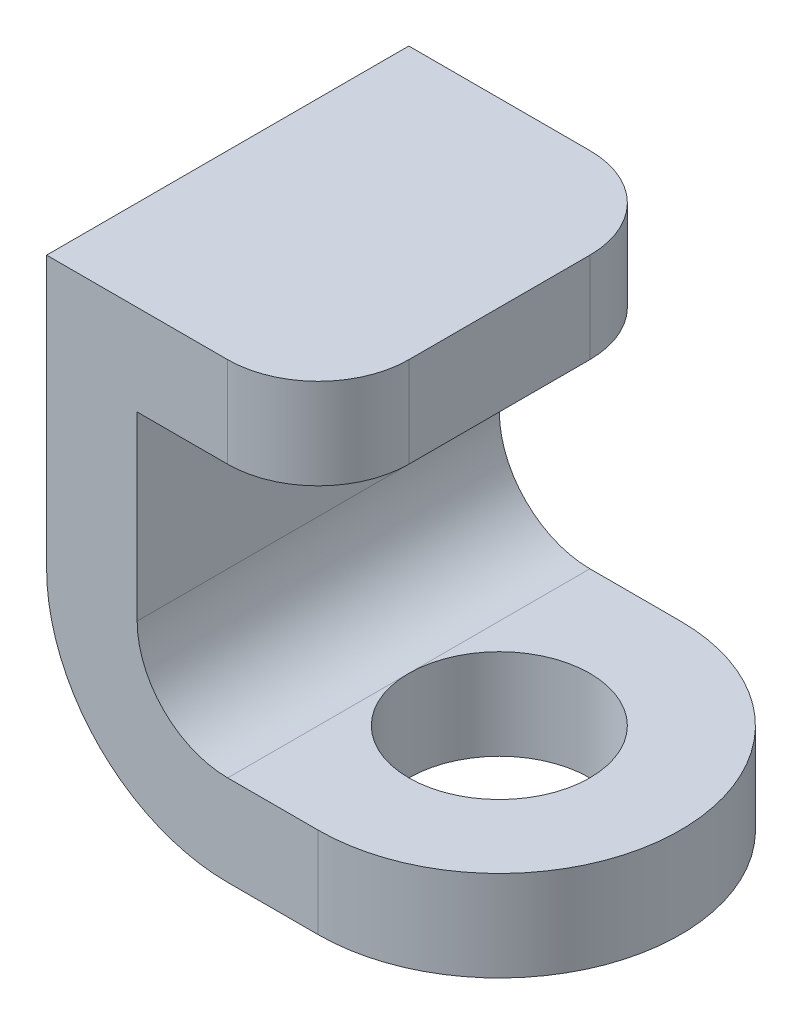
ISO-10303-21;
HEADER;
FILE_DESCRIPTION(('STEP AP214'),'2;1');
FILE_NAME('part.step','',(''),(''),'','','');
FILE_SCHEMA(('AUTOMOTIVE_DESIGN { 1 0 10303 214 1 1 1 1 }'));
ENDSEC;
DATA;
#1=APPLICATION_CONTEXT('core data for automotive mechanical design processes');
#2=APPLICATION_PROTOCOL_DEFINITION('international standard','automotive_design',2000,#1);
#3=PRODUCT_CONTEXT('',#1,'mechanical');
#4=PRODUCT('Part','Part','',(#3));
#5=PRODUCT_RELATED_PRODUCT_CATEGORY('part','',(#4));
#6=PRODUCT_DEFINITION_FORMATION('','',#4);
#7=PRODUCT_DEFINITION_CONTEXT('part definition',#1,'design');
#8=PRODUCT_DEFINITION('design','',#6,#7);
#9=PRODUCT_DEFINITION_SHAPE('','',#8);
#10=(LENGTH_UNIT() NAMED_UNIT(*) SI_UNIT(.MILLI.,.METRE.));
#11=(NAMED_UNIT(*) PLANE_ANGLE_UNIT() SI_UNIT($,.RADIAN.));
#12=(NAMED_UNIT(*) SI_UNIT($,.STERADIAN.) SOLID_ANGLE_UNIT());
#13=UNCERTAINTY_MEASURE_WITH_UNIT(LENGTH_MEASURE(1.E-05),#10,'distance_accuracy_value','');
#14=(GEOMETRIC_REPRESENTATION_CONTEXT(3) GLOBAL_UNCERTAINTY_ASSIGNED_CONTEXT((#13)) GLOBAL_UNIT_ASSIGNED_CONTEXT((#10,
#11,#12)) REPRESENTATION_CONTEXT('',''));
#15=CARTESIAN_POINT('',(0.,0.,0.));
#16=DIRECTION('',(0.,0.,1.));
#17=DIRECTION('',(1.,0.,0.));
#18=AXIS2_PLACEMENT_3D('',#15,#16,#17);
#19=CARTESIAN_POINT('',(-10.,25.,0.));
#20=DIRECTION('',(-1.,0.,0.));
#21=DIRECTION('',(0.,0.,1.));
#22=AXIS2_PLACEMENT_3D('',#19,#20,#21);
#23=PLANE('',#22);
#24=DIRECTION('',(0.,-1.,0.));
#25=VECTOR('',#24,1.);
#26=CARTESIAN_POINT('',(-10.,25.,10.));
#27=LINE('',#26,#25);
#28=CARTESIAN_POINT('',(-10.,20.,10.));
#29=VERTEX_POINT('',#28);
#30=CARTESIAN_POINT('',(-10.,10.,10.));
#31=VERTEX_POINT('',#30);
#32=EDGE_CURVE('E147',#29,#31,#27,.T.);
#33=ORIENTED_EDGE('',*,*,#32,.T.);
#34=DIRECTION('',(0.,0.,-1.));
#35=VECTOR('',#34,1.);
#36=CARTESIAN_POINT('',(-10.,10.,0.));
#37=LINE('',#36,#35);
#38=CARTESIAN_POINT('',(-10.,10.,-10.));
#39=VERTEX_POINT('',#38);
#40=EDGE_CURVE('E213',#31,#39,#37,.T.);
#41=ORIENTED_EDGE('',*,*,#40,.T.);
#42=DIRECTION('',(0.,-1.,0.));
#43=VECTOR('',#42,1.);
#44=CARTESIAN_POINT('',(-10.,25.,-10.));
#45=LINE('',#44,#43);
#46=CARTESIAN_POINT('',(-10.,20.,-10.));
#47=VERTEX_POINT('',#46);
#48=EDGE_CURVE('E149',#47,#39,#45,.T.);
#49=ORIENTED_EDGE('',*,*,#48,.F.);
#50=DIRECTION('',(0.,0.,-1.));
#51=VECTOR('',#50,1.);
#52=CARTESIAN_POINT('',(-10.,20.,10.));
#53=LINE('',#52,#51);
#54=EDGE_CURVE('E134',#29,#47,#53,.T.);
#55=ORIENTED_EDGE('',*,*,#54,.F.);
#56=EDGE_LOOP('',(#33,#41,#49,#55));
#57=FACE_BOUND('',#56,.T.);
#58=ADVANCED_FACE('F35',(#57),#23,.F.);
#59=CARTESIAN_POINT('',(0.,5.,10.));
#60=DIRECTION('',(0.,0.,-1.));
#61=DIRECTION('',(-1.,0.,0.));
#62=AXIS2_PLACEMENT_3D('',#59,#60,#61);
#63=PLANE('',#62);
#64=DIRECTION('',(0.,-1.,0.));
#65=VECTOR('',#64,1.);
#66=CARTESIAN_POINT('',(-15.,25.,10.));
#67=LINE('',#66,#65);
#68=CARTESIAN_POINT('',(-15.,25.,10.));
#69=VERTEX_POINT('',#68);
#70=CARTESIAN_POINT('',(-15.,10.,10.));
#71=VERTEX_POINT('',#70);
#72=EDGE_CURVE('E247',#69,#71,#67,.T.);
#73=ORIENTED_EDGE('',*,*,#72,.T.);
#74=CARTESIAN_POINT('',(-5.,10.,10.));
#75=DIRECTION('',(0.,0.,-1.));
#76=DIRECTION('',(-1.,0.,0.));
#77=AXIS2_PLACEMENT_3D('',#74,#75,#76);
#78=CIRCLE('',#77,10.);
#79=CARTESIAN_POINT('',(-5.,0.,10.));
#80=VERTEX_POINT('',#79);
#81=EDGE_CURVE('E205',#71,#80,#78,.F.);
#82=ORIENTED_EDGE('',*,*,#81,.T.);
#83=DIRECTION('',(1.,0.,0.));
#84=VECTOR('',#83,1.);
#85=CARTESIAN_POINT('',(0.,0.,10.));
#86=LINE('',#85,#84);
#87=CARTESIAN_POINT('',(0.,0.,10.));
#88=VERTEX_POINT('',#87);
#89=EDGE_CURVE('E158',#80,#88,#86,.T.);
#90=ORIENTED_EDGE('',*,*,#89,.T.);
#91=DIRECTION('',(0.,-1.,0.));
#92=VECTOR('',#91,1.);
#93=CARTESIAN_POINT('',(0.,5.,10.));
#94=LINE('',#93,#92);
#95=CARTESIAN_POINT('',(0.,5.,10.));
#96=VERTEX_POINT('',#95);
#97=EDGE_CURVE('E182',#96,#88,#94,.T.);
#98=ORIENTED_EDGE('',*,*,#97,.F.);
#99=DIRECTION('',(1.,0.,0.));
#100=VECTOR('',#99,1.);
#101=CARTESIAN_POINT('',(0.,5.,10.));
#102=LINE('',#101,#100);
#103=CARTESIAN_POINT('',(-5.,5.,10.));
#104=VERTEX_POINT('',#103);
#105=EDGE_CURVE('E167',#104,#96,#102,.T.);
#106=ORIENTED_EDGE('',*,*,#105,.F.);
#107=CARTESIAN_POINT('',(-5.,10.,10.));
#108=DIRECTION('',(0.,0.,-1.));
#109=DIRECTION('',(-1.,0.,0.));
#110=AXIS2_PLACEMENT_3D('',#107,#108,#109);
#111=CIRCLE('',#110,5.);
#112=EDGE_CURVE('E11',#104,#31,#111,.T.);
#113=ORIENTED_EDGE('',*,*,#112,.T.);
#114=ORIENTED_EDGE('',*,*,#32,.F.);
#115=DIRECTION('',(-1.,0.,0.));
#116=VECTOR('',#115,1.);
#117=CARTESIAN_POINT('',(0.,20.,10.));
#118=LINE('',#117,#116);
#119=CARTESIAN_POINT('',(-5.,20.,10.));
#120=VERTEX_POINT('',#119);
#121=EDGE_CURVE('E130',#120,#29,#118,.T.);
#122=ORIENTED_EDGE('',*,*,#121,.F.);
#123=DIRECTION('',(0.,-1.,0.));
#124=VECTOR('',#123,1.);
#125=CARTESIAN_POINT('',(-5.,25.,10.));
#126=LINE('',#125,#124);
#127=CARTESIAN_POINT('',(-5.,25.,10.));
#128=VERTEX_POINT('',#127);
#129=EDGE_CURVE('E200',#120,#128,#126,.F.);
#130=ORIENTED_EDGE('',*,*,#129,.T.);
#131=DIRECTION('',(1.,0.,0.));
#132=VECTOR('',#131,1.);
#133=CARTESIAN_POINT('',(0.,25.,10.));
#134=LINE('',#133,#132);
#135=EDGE_CURVE('E141',#69,#128,#134,.T.);
#136=ORIENTED_EDGE('',*,*,#135,.F.);
#137=EDGE_LOOP('',(#73,#82,#90,#98,#106,#113,#114,#122,#130,#136));
#138=FACE_BOUND('',#137,.T.);
#139=ADVANCED_FACE('F153',(#138),#63,.F.);
#140=CARTESIAN_POINT('',(0.,5.,0.));
#141=DIRECTION('',(0.,-1.,0.));
#142=DIRECTION('',(0.,0.,-1.));
#143=AXIS2_PLACEMENT_3D('',#140,#141,#142);
#144=CYLINDRICAL_SURFACE('',#143,10.);
#145=CARTESIAN_POINT('',(0.,0.,0.));
#146=DIRECTION('',(0.,1.,0.));
#147=DIRECTION('',(0.,0.,1.));
#148=AXIS2_PLACEMENT_3D('',#145,#146,#147);
#149=CIRCLE('',#148,10.);
#150=CARTESIAN_POINT('',(0.,0.,-10.));
#151=VERTEX_POINT('',#150);
#152=EDGE_CURVE('E176',#88,#151,#149,.T.);
#153=ORIENTED_EDGE('',*,*,#152,.T.);
#154=DIRECTION('',(0.,-1.,0.));
#155=VECTOR('',#154,1.);
#156=CARTESIAN_POINT('',(0.,5.,-10.));
#157=LINE('',#156,#155);
#158=CARTESIAN_POINT('',(0.,5.,-10.));
#159=VERTEX_POINT('',#158);
#160=EDGE_CURVE('E173',#159,#151,#157,.T.);
#161=ORIENTED_EDGE('',*,*,#160,.F.);
#162=CARTESIAN_POINT('',(0.,5.,0.));
#163=DIRECTION('',(0.,1.,0.));
#164=DIRECTION('',(0.,0.,1.));
#165=AXIS2_PLACEMENT_3D('',#162,#163,#164);
#166=CIRCLE('',#165,10.);
#167=EDGE_CURVE('E170',#96,#159,#166,.T.);
#168=ORIENTED_EDGE('',*,*,#167,.F.);
#169=ORIENTED_EDGE('',*,*,#97,.T.);
#170=EDGE_LOOP('',(#153,#161,#168,#169));
#171=FACE_BOUND('',#170,.T.);
#172=ADVANCED_FACE('F243',(#171),#144,.T.);
#173=CARTESIAN_POINT('',(0.,5.,-10.));
#174=DIRECTION('',(0.,0.,1.));
#175=DIRECTION('',(1.,0.,0.));
#176=AXIS2_PLACEMENT_3D('',#173,#174,#175);
#177=PLANE('',#176);
#178=DIRECTION('',(-1.,0.,0.));
#179=VECTOR('',#178,1.);
#180=CARTESIAN_POINT('',(0.,0.,-10.));
#181=LINE('',#180,#179);
#182=CARTESIAN_POINT('',(-5.,0.,-10.));
#183=VERTEX_POINT('',#182);
#184=EDGE_CURVE('E168',#151,#183,#181,.T.);
#185=ORIENTED_EDGE('',*,*,#184,.T.);
#186=CARTESIAN_POINT('',(-5.,10.,-10.));
#187=DIRECTION('',(0.,0.,1.));
#188=DIRECTION('',(1.,0.,0.));
#189=AXIS2_PLACEMENT_3D('',#186,#187,#188);
#190=CIRCLE('',#189,10.);
#191=CARTESIAN_POINT('',(-15.,10.,-10.));
#192=VERTEX_POINT('',#191);
#193=EDGE_CURVE('E211',#183,#192,#190,.F.);
#194=ORIENTED_EDGE('',*,*,#193,.T.);
#195=DIRECTION('',(0.,-1.,0.));
#196=VECTOR('',#195,1.);
#197=CARTESIAN_POINT('',(-15.,25.,-10.));
#198=LINE('',#197,#196);
#199=CARTESIAN_POINT('',(-15.,25.,-10.));
#200=VERTEX_POINT('',#199);
#201=EDGE_CURVE('E160',#200,#192,#198,.T.);
#202=ORIENTED_EDGE('',*,*,#201,.F.);
#203=DIRECTION('',(-1.,0.,0.));
#204=VECTOR('',#203,1.);
#205=CARTESIAN_POINT('',(0.,25.,-10.));
#206=LINE('',#205,#204);
#207=CARTESIAN_POINT('',(-5.,25.,-10.));
#208=VERTEX_POINT('',#207);
#209=EDGE_CURVE('E256',#208,#200,#206,.T.);
#210=ORIENTED_EDGE('',*,*,#209,.F.);
#211=DIRECTION('',(0.,1.,0.));
#212=VECTOR('',#211,1.);
#213=CARTESIAN_POINT('',(-5.,20.,-10.));
#214=LINE('',#213,#212);
#215=CARTESIAN_POINT('',(-5.,20.,-10.));
#216=VERTEX_POINT('',#215);
#217=EDGE_CURVE('E195',#208,#216,#214,.F.);
#218=ORIENTED_EDGE('',*,*,#217,.T.);
#219=DIRECTION('',(-1.,0.,0.));
#220=VECTOR('',#219,1.);
#221=CARTESIAN_POINT('',(0.,20.,-10.));
#222=LINE('',#221,#220);
#223=EDGE_CURVE('E142',#216,#47,#222,.T.);
#224=ORIENTED_EDGE('',*,*,#223,.T.);
#225=ORIENTED_EDGE('',*,*,#48,.T.);
#226=CARTESIAN_POINT('',(-5.,10.,-10.));
#227=DIRECTION('',(0.,0.,1.));
#228=DIRECTION('',(1.,0.,0.));
#229=AXIS2_PLACEMENT_3D('',#226,#227,#228);
#230=CIRCLE('',#229,5.);
#231=CARTESIAN_POINT('',(-5.,5.,-10.));
#232=VERTEX_POINT('',#231);
#233=EDGE_CURVE('E43',#39,#232,#230,.T.);
#234=ORIENTED_EDGE('',*,*,#233,.T.);
#235=DIRECTION('',(-1.,0.,0.));
#236=VECTOR('',#235,1.);
#237=CARTESIAN_POINT('',(0.,5.,-10.));
#238=LINE('',#237,#236);
#239=EDGE_CURVE('E172',#159,#232,#238,.T.);
#240=ORIENTED_EDGE('',*,*,#239,.F.);
#241=ORIENTED_EDGE('',*,*,#160,.T.);
#242=EDGE_LOOP('',(#185,#194,#202,#210,#218,#224,#225,#234,#240,#241));
#243=FACE_BOUND('',#242,.T.);
#244=ADVANCED_FACE('F224',(#243),#177,.F.);
#245=CARTESIAN_POINT('',(0.,5.,0.));
#246=DIRECTION('',(0.,-1.,0.));
#247=DIRECTION('',(0.,0.,-1.));
#248=AXIS2_PLACEMENT_3D('',#245,#246,#247);
#249=CYLINDRICAL_SURFACE('',#248,5.);
#250=CARTESIAN_POINT('',(0.,5.,0.));
#251=DIRECTION('',(0.,1.,0.));
#252=DIRECTION('',(0.,0.,1.));
#253=AXIS2_PLACEMENT_3D('',#250,#251,#252);
#254=CIRCLE('',#253,5.);
#255=CARTESIAN_POINT('',(-5.,5.,0.));
#256=VERTEX_POINT('',#255);
#257=EDGE_CURVE('E164',#256,#256,#254,.T.);
#258=ORIENTED_EDGE('',*,*,#257,.T.);
#259=EDGE_LOOP('',(#258));
#260=FACE_BOUND('',#259,.T.);
#261=CARTESIAN_POINT('',(0.,0.,0.));
#262=DIRECTION('',(0.,1.,0.));
#263=DIRECTION('',(0.,0.,1.));
#264=AXIS2_PLACEMENT_3D('',#261,#262,#263);
#265=CIRCLE('',#264,5.);
#266=CARTESIAN_POINT('',(-5.,0.,0.));
#267=VERTEX_POINT('',#266);
#268=EDGE_CURVE('E155',#267,#267,#265,.T.);
#269=ORIENTED_EDGE('',*,*,#268,.F.);
#270=EDGE_LOOP('',(#269));
#271=FACE_BOUND('',#270,.T.);
#272=ADVANCED_FACE('F221',(#260,#271),#249,.F.);
#273=CARTESIAN_POINT('',(0.,5.,0.));
#274=DIRECTION('',(0.,1.,0.));
#275=DIRECTION('',(0.,0.,1.));
#276=AXIS2_PLACEMENT_3D('',#273,#274,#275);
#277=PLANE('',#276);
#278=ORIENTED_EDGE('',*,*,#239,.T.);
#279=DIRECTION('',(0.,0.,-1.));
#280=VECTOR('',#279,1.);
#281=CARTESIAN_POINT('',(-5.,5.,0.));
#282=LINE('',#281,#280);
#283=EDGE_CURVE('E216',#232,#256,#282,.F.);
#284=ORIENTED_EDGE('',*,*,#283,.T.);
#285=ORIENTED_EDGE('',*,*,#257,.F.);
#286=DIRECTION('',(0.,0.,-1.));
#287=VECTOR('',#286,1.);
#288=CARTESIAN_POINT('',(-5.,5.,0.));
#289=LINE('',#288,#287);
#290=EDGE_CURVE('E57',#256,#104,#289,.F.);
#291=ORIENTED_EDGE('',*,*,#290,.T.);
#292=ORIENTED_EDGE('',*,*,#105,.T.);
#293=ORIENTED_EDGE('',*,*,#167,.T.);
#294=EDGE_LOOP('',(#278,#284,#285,#291,#292,#293));
#295=FACE_BOUND('',#294,.T.);
#296=ADVANCED_FACE('F218',(#295),#277,.T.);
#297=CARTESIAN_POINT('',(0.,0.,0.));
#298=DIRECTION('',(0.,1.,0.));
#299=DIRECTION('',(0.,0.,1.));
#300=AXIS2_PLACEMENT_3D('',#297,#298,#299);
#301=PLANE('',#300);
#302=ORIENTED_EDGE('',*,*,#89,.F.);
#303=DIRECTION('',(0.,0.,1.));
#304=VECTOR('',#303,1.);
#305=CARTESIAN_POINT('',(-5.,0.,0.));
#306=LINE('',#305,#304);
#307=EDGE_CURVE('E209',#80,#267,#306,.F.);
#308=ORIENTED_EDGE('',*,*,#307,.T.);
#309=ORIENTED_EDGE('',*,*,#268,.T.);
#310=DIRECTION('',(0.,0.,1.));
#311=VECTOR('',#310,1.);
#312=CARTESIAN_POINT('',(-5.,0.,0.));
#313=LINE('',#312,#311);
#314=EDGE_CURVE('E207',#267,#183,#313,.F.);
#315=ORIENTED_EDGE('',*,*,#314,.T.);
#316=ORIENTED_EDGE('',*,*,#184,.F.);
#317=ORIENTED_EDGE('',*,*,#152,.F.);
#318=EDGE_LOOP('',(#302,#308,#309,#315,#316,#317));
#319=FACE_BOUND('',#318,.T.);
#320=ADVANCED_FACE('F236',(#319),#301,.F.);
#321=CARTESIAN_POINT('',(-15.,25.,0.));
#322=DIRECTION('',(1.,0.,0.));
#323=DIRECTION('',(0.,0.,-1.));
#324=AXIS2_PLACEMENT_3D('',#321,#322,#323);
#325=PLANE('',#324);
#326=ORIENTED_EDGE('',*,*,#201,.T.);
#327=DIRECTION('',(0.,0.,1.));
#328=VECTOR('',#327,1.);
#329=CARTESIAN_POINT('',(-15.,10.,0.));
#330=LINE('',#329,#328);
#331=EDGE_CURVE('E202',#192,#71,#330,.T.);
#332=ORIENTED_EDGE('',*,*,#331,.T.);
#333=ORIENTED_EDGE('',*,*,#72,.F.);
#334=DIRECTION('',(0.,0.,1.));
#335=VECTOR('',#334,1.);
#336=CARTESIAN_POINT('',(-15.,25.,0.));
#337=LINE('',#336,#335);
#338=EDGE_CURVE('E251',#200,#69,#337,.T.);
#339=ORIENTED_EDGE('',*,*,#338,.F.);
#340=EDGE_LOOP('',(#326,#332,#333,#339));
#341=FACE_BOUND('',#340,.T.);
#342=ADVANCED_FACE('F249',(#341),#325,.F.);
#343=CARTESIAN_POINT('',(0.,25.,0.));
#344=DIRECTION('',(0.,1.,0.));
#345=DIRECTION('',(0.,0.,1.));
#346=AXIS2_PLACEMENT_3D('',#343,#344,#345);
#347=PLANE('',#346);
#348=DIRECTION('',(0.,0.,1.));
#349=VECTOR('',#348,1.);
#350=CARTESIAN_POINT('',(0.,25.,10.));
#351=LINE('',#350,#349);
#352=CARTESIAN_POINT('',(0.,25.,-5.));
#353=VERTEX_POINT('',#352);
#354=CARTESIAN_POINT('',(0.,25.,5.));
#355=VERTEX_POINT('',#354);
#356=EDGE_CURVE('E260',#353,#355,#351,.T.);
#357=ORIENTED_EDGE('',*,*,#356,.F.);
#358=CARTESIAN_POINT('',(-5.,25.,-5.));
#359=DIRECTION('',(0.,1.,0.));
#360=DIRECTION('',(0.,0.,1.));
#361=AXIS2_PLACEMENT_3D('',#358,#359,#360);
#362=CIRCLE('',#361,5.);
#363=EDGE_CURVE('E193',#353,#208,#362,.T.);
#364=ORIENTED_EDGE('',*,*,#363,.T.);
#365=ORIENTED_EDGE('',*,*,#209,.T.);
#366=ORIENTED_EDGE('',*,*,#338,.T.);
#367=ORIENTED_EDGE('',*,*,#135,.T.);
#368=CARTESIAN_POINT('',(-5.,25.,5.));
#369=DIRECTION('',(0.,1.,0.));
#370=DIRECTION('',(0.,0.,1.));
#371=AXIS2_PLACEMENT_3D('',#368,#369,#370);
#372=CIRCLE('',#371,5.);
#373=EDGE_CURVE('E191',#128,#355,#372,.T.);
#374=ORIENTED_EDGE('',*,*,#373,.T.);
#375=EDGE_LOOP('',(#357,#364,#365,#366,#367,#374));
#376=FACE_BOUND('',#375,.T.);
#377=ADVANCED_FACE('F275',(#376),#347,.T.);
#378=CARTESIAN_POINT('',(0.,20.,10.));
#379=DIRECTION('',(0.,1.,0.));
#380=DIRECTION('',(0.,0.,1.));
#381=AXIS2_PLACEMENT_3D('',#378,#379,#380);
#382=PLANE('',#381);
#383=ORIENTED_EDGE('',*,*,#223,.F.);
#384=CARTESIAN_POINT('',(-5.,20.,-5.));
#385=DIRECTION('',(0.,1.,0.));
#386=DIRECTION('',(0.,0.,1.));
#387=AXIS2_PLACEMENT_3D('',#384,#385,#386);
#388=CIRCLE('',#387,5.);
#389=CARTESIAN_POINT('',(0.,20.,-5.));
#390=VERTEX_POINT('',#389);
#391=EDGE_CURVE('E198',#216,#390,#388,.F.);
#392=ORIENTED_EDGE('',*,*,#391,.T.);
#393=DIRECTION('',(0.,0.,-1.));
#394=VECTOR('',#393,1.);
#395=CARTESIAN_POINT('',(0.,20.,10.));
#396=LINE('',#395,#394);
#397=CARTESIAN_POINT('',(0.,20.,5.));
#398=VERTEX_POINT('',#397);
#399=EDGE_CURVE('E150',#398,#390,#396,.T.);
#400=ORIENTED_EDGE('',*,*,#399,.F.);
#401=CARTESIAN_POINT('',(-5.,20.,5.));
#402=DIRECTION('',(0.,1.,0.));
#403=DIRECTION('',(0.,0.,1.));
#404=AXIS2_PLACEMENT_3D('',#401,#402,#403);
#405=CIRCLE('',#404,5.);
#406=EDGE_CURVE('E137',#398,#120,#405,.F.);
#407=ORIENTED_EDGE('',*,*,#406,.T.);
#408=ORIENTED_EDGE('',*,*,#121,.T.);
#409=ORIENTED_EDGE('',*,*,#54,.T.);
#410=EDGE_LOOP('',(#383,#392,#400,#407,#408,#409));
#411=FACE_BOUND('',#410,.T.);
#412=ADVANCED_FACE('F133',(#411),#382,.F.);
#413=CARTESIAN_POINT('',(0.,0.,0.));
#414=DIRECTION('',(1.,0.,0.));
#415=DIRECTION('',(0.,0.,-1.));
#416=AXIS2_PLACEMENT_3D('',#413,#414,#415);
#417=PLANE('',#416);
#418=ORIENTED_EDGE('',*,*,#399,.T.);
#419=DIRECTION('',(0.,1.,0.));
#420=VECTOR('',#419,1.);
#421=CARTESIAN_POINT('',(0.,25.,-5.));
#422=LINE('',#421,#420);
#423=EDGE_CURVE('E188',#390,#353,#422,.T.);
#424=ORIENTED_EDGE('',*,*,#423,.T.);
#425=ORIENTED_EDGE('',*,*,#356,.T.);
#426=DIRECTION('',(0.,-1.,0.));
#427=VECTOR('',#426,1.);
#428=CARTESIAN_POINT('',(0.,20.,5.));
#429=LINE('',#428,#427);
#430=EDGE_CURVE('E185',#355,#398,#429,.T.);
#431=ORIENTED_EDGE('',*,*,#430,.T.);
#432=EDGE_LOOP('',(#418,#424,#425,#431));
#433=FACE_BOUND('',#432,.T.);
#434=ADVANCED_FACE('F267',(#433),#417,.T.);
#435=CARTESIAN_POINT('',(-5.,0.,-5.));
#436=DIRECTION('',(0.,-1.,0.));
#437=DIRECTION('',(0.,0.,-1.));
#438=AXIS2_PLACEMENT_3D('',#435,#436,#437);
#439=CYLINDRICAL_SURFACE('',#438,5.);
#440=ORIENTED_EDGE('',*,*,#391,.F.);
#441=ORIENTED_EDGE('',*,*,#217,.F.);
#442=ORIENTED_EDGE('',*,*,#363,.F.);
#443=ORIENTED_EDGE('',*,*,#423,.F.);
#444=EDGE_LOOP('',(#440,#441,#442,#443));
#445=FACE_BOUND('',#444,.T.);
#446=ADVANCED_FACE('F272',(#445),#439,.T.);
#447=CARTESIAN_POINT('',(-5.,0.,5.));
#448=DIRECTION('',(0.,1.,0.));
#449=DIRECTION('',(0.,0.,1.));
#450=AXIS2_PLACEMENT_3D('',#447,#448,#449);
#451=CYLINDRICAL_SURFACE('',#450,5.);
#452=ORIENTED_EDGE('',*,*,#373,.F.);
#453=ORIENTED_EDGE('',*,*,#129,.F.);
#454=ORIENTED_EDGE('',*,*,#406,.F.);
#455=ORIENTED_EDGE('',*,*,#430,.F.);
#456=EDGE_LOOP('',(#452,#453,#454,#455));
#457=FACE_BOUND('',#456,.T.);
#458=ADVANCED_FACE('F278',(#457),#451,.T.);
#459=CARTESIAN_POINT('',(-5.,10.,0.));
#460=DIRECTION('',(0.,0.,1.));
#461=DIRECTION('',(1.,0.,0.));
#462=AXIS2_PLACEMENT_3D('',#459,#460,#461);
#463=CYLINDRICAL_SURFACE('',#462,10.);
#464=ORIENTED_EDGE('',*,*,#314,.F.);
#465=ORIENTED_EDGE('',*,*,#307,.F.);
#466=ORIENTED_EDGE('',*,*,#81,.F.);
#467=ORIENTED_EDGE('',*,*,#331,.F.);
#468=ORIENTED_EDGE('',*,*,#193,.F.);
#469=EDGE_LOOP('',(#464,#465,#466,#467,#468));
#470=FACE_BOUND('',#469,.T.);
#471=ADVANCED_FACE('F232',(#470),#463,.T.);
#472=CARTESIAN_POINT('',(-5.,10.,0.));
#473=DIRECTION('',(0.,0.,-1.));
#474=DIRECTION('',(-1.,0.,0.));
#475=AXIS2_PLACEMENT_3D('',#472,#473,#474);
#476=CYLINDRICAL_SURFACE('',#475,5.);
#477=ORIENTED_EDGE('',*,*,#290,.F.);
#478=ORIENTED_EDGE('',*,*,#283,.F.);
#479=ORIENTED_EDGE('',*,*,#233,.F.);
#480=ORIENTED_EDGE('',*,*,#40,.F.);
#481=ORIENTED_EDGE('',*,*,#112,.F.);
#482=EDGE_LOOP('',(#477,#478,#479,#480,#481));
#483=FACE_BOUND('',#482,.T.);
#484=ADVANCED_FACE('F37',(#483),#476,.F.);
#485=CLOSED_SHELL('',(#58,#139,#172,#244,#272,#296,#320,#342,#377,#412,#434,#446,#458,#471,#484));
#486=MANIFOLD_SOLID_BREP('B2',#485);
#487=ADVANCED_BREP_SHAPE_REPRESENTATION('',(#18,#486),#14);
#488=SHAPE_DEFINITION_REPRESENTATION(#9,#487);
ENDSEC;
END-ISO-10303-21;
